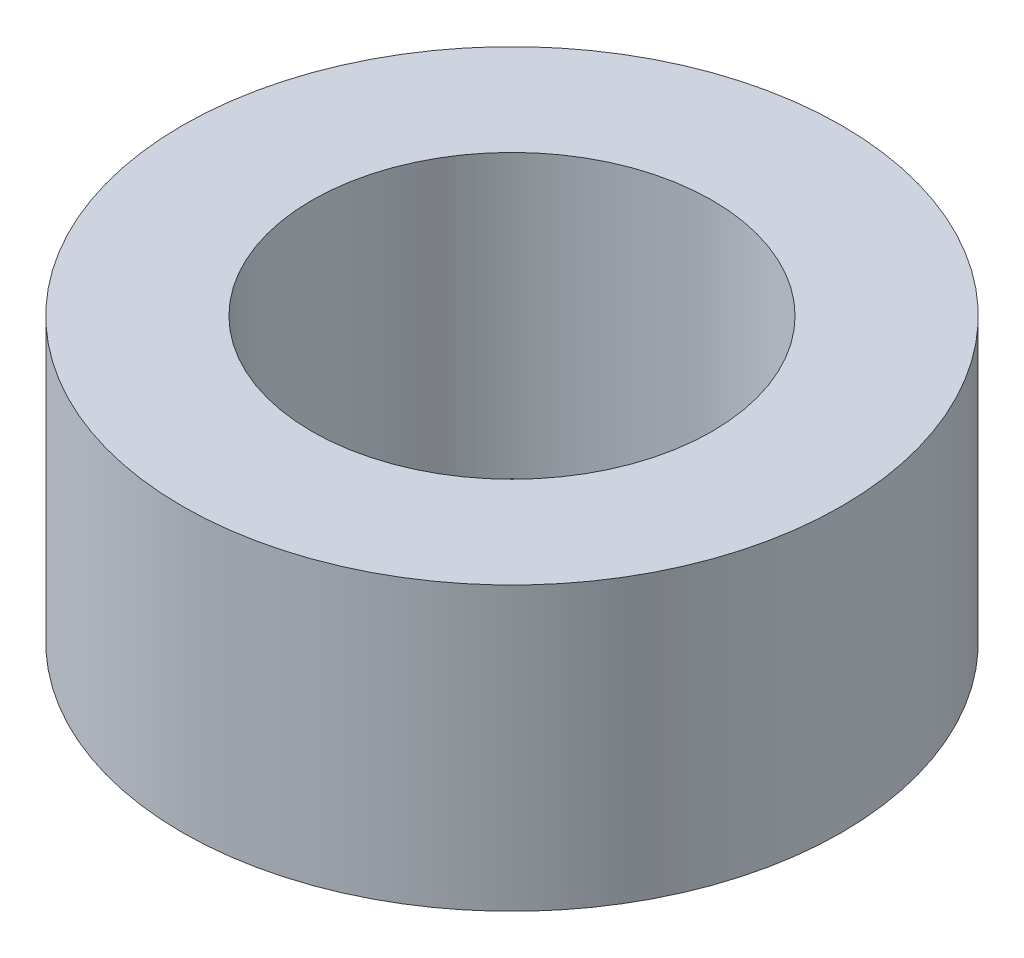
ISO-10303-21;
HEADER;
FILE_DESCRIPTION(('STEP AP214'),'2;1');
FILE_NAME('part.step','',(''),(''),'','','');
FILE_SCHEMA(('AUTOMOTIVE_DESIGN { 1 0 10303 214 1 1 1 1 }'));
ENDSEC;
DATA;
#1=APPLICATION_CONTEXT('core data for automotive mechanical design processes');
#2=APPLICATION_PROTOCOL_DEFINITION('international standard','automotive_design',2000,#1);
#3=PRODUCT_CONTEXT('',#1,'mechanical');
#4=PRODUCT('Part','Part','',(#3));
#5=PRODUCT_RELATED_PRODUCT_CATEGORY('part','',(#4));
#6=PRODUCT_DEFINITION_FORMATION('','',#4);
#7=PRODUCT_DEFINITION_CONTEXT('part definition',#1,'design');
#8=PRODUCT_DEFINITION('design','',#6,#7);
#9=PRODUCT_DEFINITION_SHAPE('','',#8);
#10=(LENGTH_UNIT() NAMED_UNIT(*) SI_UNIT(.MILLI.,.METRE.));
#11=(NAMED_UNIT(*) PLANE_ANGLE_UNIT() SI_UNIT($,.RADIAN.));
#12=(NAMED_UNIT(*) SI_UNIT($,.STERADIAN.) SOLID_ANGLE_UNIT());
#13=UNCERTAINTY_MEASURE_WITH_UNIT(LENGTH_MEASURE(1.E-05),#10,'distance_accuracy_value','');
#14=(GEOMETRIC_REPRESENTATION_CONTEXT(3) GLOBAL_UNCERTAINTY_ASSIGNED_CONTEXT((#13)) GLOBAL_UNIT_ASSIGNED_CONTEXT((#10,
#11,#12)) REPRESENTATION_CONTEXT('',''));
#15=CARTESIAN_POINT('',(0.,0.,0.));
#16=DIRECTION('',(0.,0.,1.));
#17=DIRECTION('',(1.,0.,0.));
#18=AXIS2_PLACEMENT_3D('',#15,#16,#17);
#19=CARTESIAN_POINT('',(0.,3.,0.));
#20=DIRECTION('',(0.,1.,0.));
#21=DIRECTION('',(0.,0.,1.));
#22=AXIS2_PLACEMENT_3D('',#19,#20,#21);
#23=PLANE('',#22);
#24=CARTESIAN_POINT('',(0.,3.,0.));
#25=DIRECTION('',(0.,1.,0.));
#26=DIRECTION('',(0.,0.,1.));
#27=AXIS2_PLACEMENT_3D('',#24,#25,#26);
#28=CIRCLE('',#27,3.5);
#29=CARTESIAN_POINT('',(0.,3.,3.5));
#30=VERTEX_POINT('',#29);
#31=EDGE_CURVE('E10',#30,#30,#28,.T.);
#32=ORIENTED_EDGE('',*,*,#31,.T.);
#33=EDGE_LOOP('',(#32));
#34=FACE_BOUND('',#33,.T.);
#35=CARTESIAN_POINT('',(0.,3.,0.));
#36=DIRECTION('',(0.,1.,0.));
#37=DIRECTION('',(0.,0.,1.));
#38=AXIS2_PLACEMENT_3D('',#35,#36,#37);
#39=CIRCLE('',#38,2.125);
#40=CARTESIAN_POINT('',(0.,3.,2.125));
#41=VERTEX_POINT('',#40);
#42=EDGE_CURVE('E41',#41,#41,#39,.T.);
#43=ORIENTED_EDGE('',*,*,#42,.F.);
#44=EDGE_LOOP('',(#43));
#45=FACE_BOUND('',#44,.T.);
#46=ADVANCED_FACE('F30',(#34,#45),#23,.T.);
#47=CARTESIAN_POINT('',(0.,0.,0.));
#48=DIRECTION('',(0.,1.,0.));
#49=DIRECTION('',(0.,0.,1.));
#50=AXIS2_PLACEMENT_3D('',#47,#48,#49);
#51=PLANE('',#50);
#52=CARTESIAN_POINT('',(0.,0.,0.));
#53=DIRECTION('',(0.,1.,0.));
#54=DIRECTION('',(0.,0.,1.));
#55=AXIS2_PLACEMENT_3D('',#52,#53,#54);
#56=CIRCLE('',#55,3.5);
#57=CARTESIAN_POINT('',(0.,0.,3.5));
#58=VERTEX_POINT('',#57);
#59=EDGE_CURVE('E34',#58,#58,#56,.T.);
#60=ORIENTED_EDGE('',*,*,#59,.F.);
#61=EDGE_LOOP('',(#60));
#62=FACE_BOUND('',#61,.T.);
#63=CARTESIAN_POINT('',(0.,0.,0.));
#64=DIRECTION('',(0.,1.,0.));
#65=DIRECTION('',(0.,0.,1.));
#66=AXIS2_PLACEMENT_3D('',#63,#64,#65);
#67=CIRCLE('',#66,2.125);
#68=CARTESIAN_POINT('',(0.,0.,2.125));
#69=VERTEX_POINT('',#68);
#70=EDGE_CURVE('E43',#69,#69,#67,.T.);
#71=ORIENTED_EDGE('',*,*,#70,.T.);
#72=EDGE_LOOP('',(#71));
#73=FACE_BOUND('',#72,.T.);
#74=ADVANCED_FACE('F53',(#62,#73),#51,.F.);
#75=CARTESIAN_POINT('',(0.,3.,0.));
#76=DIRECTION('',(0.,-1.,0.));
#77=DIRECTION('',(0.,0.,-1.));
#78=AXIS2_PLACEMENT_3D('',#75,#76,#77);
#79=CYLINDRICAL_SURFACE('',#78,3.5);
#80=ORIENTED_EDGE('',*,*,#31,.F.);
#81=EDGE_LOOP('',(#80));
#82=FACE_BOUND('',#81,.T.);
#83=ORIENTED_EDGE('',*,*,#59,.T.);
#84=EDGE_LOOP('',(#83));
#85=FACE_BOUND('',#84,.T.);
#86=ADVANCED_FACE('F32',(#82,#85),#79,.T.);
#87=CARTESIAN_POINT('',(0.,3.,0.));
#88=DIRECTION('',(0.,-1.,0.));
#89=DIRECTION('',(0.,0.,-1.));
#90=AXIS2_PLACEMENT_3D('',#87,#88,#89);
#91=CYLINDRICAL_SURFACE('',#90,2.125);
#92=ORIENTED_EDGE('',*,*,#42,.T.);
#93=EDGE_LOOP('',(#92));
#94=FACE_BOUND('',#93,.T.);
#95=ORIENTED_EDGE('',*,*,#70,.F.);
#96=EDGE_LOOP('',(#95));
#97=FACE_BOUND('',#96,.T.);
#98=ADVANCED_FACE('F49',(#94,#97),#91,.F.);
#99=CLOSED_SHELL('',(#46,#74,#86,#98));
#100=MANIFOLD_SOLID_BREP('B2',#99);
#101=ADVANCED_BREP_SHAPE_REPRESENTATION('',(#18,#100),#14);
#102=SHAPE_DEFINITION_REPRESENTATION(#9,#101);
ENDSEC;
END-ISO-10303-21;
